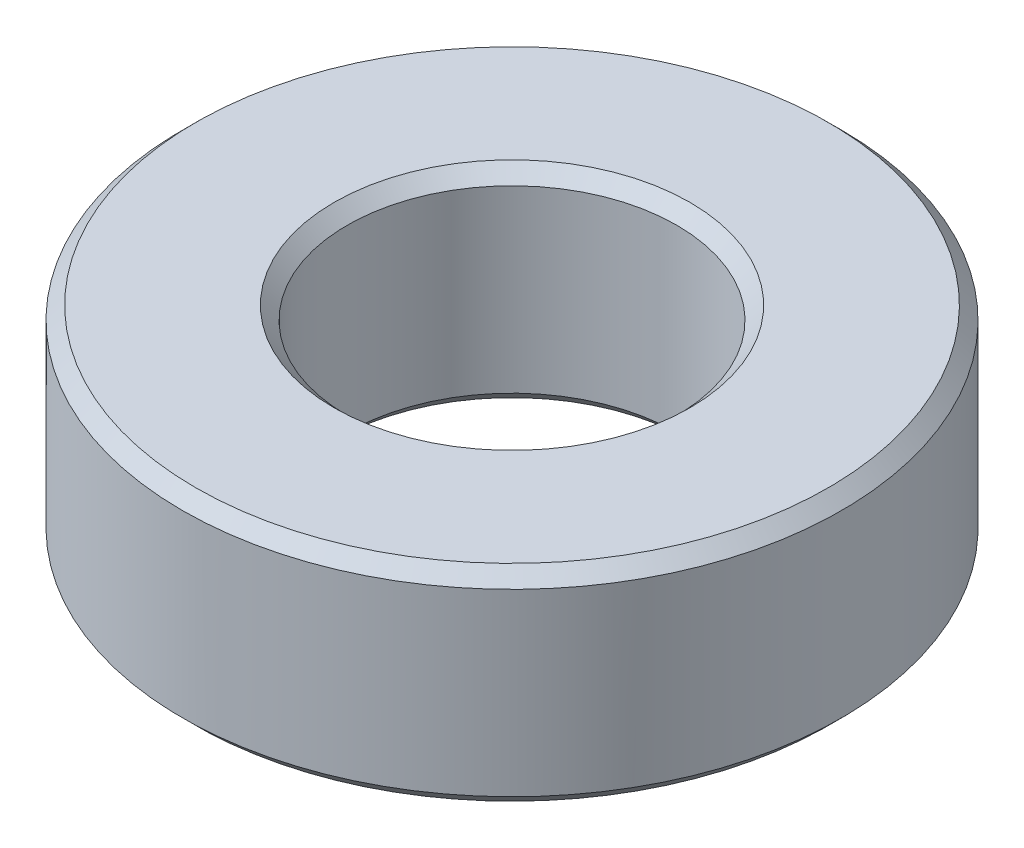
ISO-10303-21;
HEADER;
FILE_DESCRIPTION(('STEP AP214'),'2;1');
FILE_NAME('part.step','',(''),(''),'','','');
FILE_SCHEMA(('AUTOMOTIVE_DESIGN { 1 0 10303 214 1 1 1 1 }'));
ENDSEC;
DATA;
#1=APPLICATION_CONTEXT('core data for automotive mechanical design processes');
#2=APPLICATION_PROTOCOL_DEFINITION('international standard','automotive_design',2000,#1);
#3=PRODUCT_CONTEXT('',#1,'mechanical');
#4=PRODUCT('Part','Part','',(#3));
#5=PRODUCT_RELATED_PRODUCT_CATEGORY('part','',(#4));
#6=PRODUCT_DEFINITION_FORMATION('','',#4);
#7=PRODUCT_DEFINITION_CONTEXT('part definition',#1,'design');
#8=PRODUCT_DEFINITION('design','',#6,#7);
#9=PRODUCT_DEFINITION_SHAPE('','',#8);
#10=(LENGTH_UNIT() NAMED_UNIT(*) SI_UNIT(.MILLI.,.METRE.));
#11=(NAMED_UNIT(*) PLANE_ANGLE_UNIT() SI_UNIT($,.RADIAN.));
#12=(NAMED_UNIT(*) SI_UNIT($,.STERADIAN.) SOLID_ANGLE_UNIT());
#13=UNCERTAINTY_MEASURE_WITH_UNIT(LENGTH_MEASURE(1.E-05),#10,'distance_accuracy_value','');
#14=(GEOMETRIC_REPRESENTATION_CONTEXT(3) GLOBAL_UNCERTAINTY_ASSIGNED_CONTEXT((#13)) GLOBAL_UNIT_ASSIGNED_CONTEXT((#10,
#11,#12)) REPRESENTATION_CONTEXT('',''));
#15=CARTESIAN_POINT('',(0.,0.,0.));
#16=DIRECTION('',(0.,0.,1.));
#17=DIRECTION('',(1.,0.,0.));
#18=AXIS2_PLACEMENT_3D('',#15,#16,#17);
#19=CARTESIAN_POINT('',(6.35,1.984375,0.));
#20=DIRECTION('',(0.,1.,0.));
#21=DIRECTION('',(0.,0.,1.));
#22=AXIS2_PLACEMENT_3D('',#19,#20,#21);
#23=PLANE('',#22);
#24=CARTESIAN_POINT('',(0.,1.984375,0.));
#25=DIRECTION('',(0.,1.,0.));
#26=DIRECTION('',(0.,0.,1.));
#27=AXIS2_PLACEMENT_3D('',#24,#25,#26);
#28=CIRCLE('',#27,6.096);
#29=CARTESIAN_POINT('',(0.,1.984375,6.096));
#30=VERTEX_POINT('',#29);
#31=EDGE_CURVE('E41',#30,#30,#28,.T.);
#32=ORIENTED_EDGE('',*,*,#31,.T.);
#33=EDGE_LOOP('',(#32));
#34=FACE_BOUND('',#33,.T.);
#35=CARTESIAN_POINT('',(0.,1.984375,0.));
#36=DIRECTION('',(0.,1.,0.));
#37=DIRECTION('',(0.,0.,1.));
#38=AXIS2_PLACEMENT_3D('',#35,#36,#37);
#39=CIRCLE('',#38,3.429);
#40=CARTESIAN_POINT('',(0.,1.984375,3.429));
#41=VERTEX_POINT('',#40);
#42=EDGE_CURVE('E45',#41,#41,#39,.F.);
#43=ORIENTED_EDGE('',*,*,#42,.T.);
#44=EDGE_LOOP('',(#43));
#45=FACE_BOUND('',#44,.T.);
#46=ADVANCED_FACE('F30',(#34,#45),#23,.T.);
#47=CARTESIAN_POINT('',(0.,-0.652588939706115,0.));
#48=DIRECTION('',(0.,-1.,0.));
#49=DIRECTION('',(0.,0.,-1.));
#50=AXIS2_PLACEMENT_3D('',#47,#48,#49);
#51=CYLINDRICAL_SURFACE('',#50,3.175);
#52=CARTESIAN_POINT('',(0.,1.730375,0.));
#53=DIRECTION('',(0.,1.,0.));
#54=DIRECTION('',(0.,0.,1.));
#55=AXIS2_PLACEMENT_3D('',#52,#53,#54);
#56=CIRCLE('',#55,3.175);
#57=CARTESIAN_POINT('',(0.,1.730375,3.175));
#58=VERTEX_POINT('',#57);
#59=EDGE_CURVE('E10',#58,#58,#56,.T.);
#60=ORIENTED_EDGE('',*,*,#59,.T.);
#61=EDGE_LOOP('',(#60));
#62=FACE_BOUND('',#61,.T.);
#63=CARTESIAN_POINT('',(0.,-1.730375,0.));
#64=DIRECTION('',(0.,-1.,0.));
#65=DIRECTION('',(0.,0.,-1.));
#66=AXIS2_PLACEMENT_3D('',#63,#64,#65);
#67=CIRCLE('',#66,3.175);
#68=CARTESIAN_POINT('',(0.,-1.730375,-3.175));
#69=VERTEX_POINT('',#68);
#70=EDGE_CURVE('E37',#69,#69,#67,.T.);
#71=ORIENTED_EDGE('',*,*,#70,.T.);
#72=EDGE_LOOP('',(#71));
#73=FACE_BOUND('',#72,.T.);
#74=ADVANCED_FACE('F74',(#62,#73),#51,.F.);
#75=CARTESIAN_POINT('',(3.175,-1.984375,0.));
#76=DIRECTION('',(0.,-1.,0.));
#77=DIRECTION('',(0.,0.,-1.));
#78=AXIS2_PLACEMENT_3D('',#75,#76,#77);
#79=PLANE('',#78);
#80=CARTESIAN_POINT('',(0.,-1.984375,0.));
#81=DIRECTION('',(0.,-1.,0.));
#82=DIRECTION('',(0.,0.,-1.));
#83=AXIS2_PLACEMENT_3D('',#80,#81,#82);
#84=CIRCLE('',#83,6.096);
#85=CARTESIAN_POINT('',(0.,-1.984375,-6.096));
#86=VERTEX_POINT('',#85);
#87=EDGE_CURVE('E56',#86,#86,#84,.T.);
#88=ORIENTED_EDGE('',*,*,#87,.T.);
#89=EDGE_LOOP('',(#88));
#90=FACE_BOUND('',#89,.T.);
#91=CARTESIAN_POINT('',(0.,-1.984375,0.));
#92=DIRECTION('',(0.,-1.,0.));
#93=DIRECTION('',(0.,0.,-1.));
#94=AXIS2_PLACEMENT_3D('',#91,#92,#93);
#95=CIRCLE('',#94,3.429);
#96=CARTESIAN_POINT('',(0.,-1.984375,-3.429));
#97=VERTEX_POINT('',#96);
#98=EDGE_CURVE('E59',#97,#97,#95,.F.);
#99=ORIENTED_EDGE('',*,*,#98,.T.);
#100=EDGE_LOOP('',(#99));
#101=FACE_BOUND('',#100,.T.);
#102=ADVANCED_FACE('F63',(#90,#101),#79,.T.);
#103=CARTESIAN_POINT('',(0.,-0.652588939706115,0.));
#104=DIRECTION('',(0.,-1.,0.));
#105=DIRECTION('',(0.,0.,-1.));
#106=AXIS2_PLACEMENT_3D('',#103,#104,#105);
#107=CYLINDRICAL_SURFACE('',#106,6.35);
#108=CARTESIAN_POINT('',(0.,-1.73037499999999,0.));
#109=DIRECTION('',(0.,-1.,0.));
#110=DIRECTION('',(0.,0.,-1.));
#111=AXIS2_PLACEMENT_3D('',#108,#109,#110);
#112=CIRCLE('',#111,6.35);
#113=CARTESIAN_POINT('',(0.,-1.73037499999999,-6.35));
#114=VERTEX_POINT('',#113);
#115=EDGE_CURVE('E50',#114,#114,#112,.F.);
#116=ORIENTED_EDGE('',*,*,#115,.T.);
#117=EDGE_LOOP('',(#116));
#118=FACE_BOUND('',#117,.T.);
#119=CARTESIAN_POINT('',(0.,1.730375,0.));
#120=DIRECTION('',(0.,1.,0.));
#121=DIRECTION('',(0.,0.,1.));
#122=AXIS2_PLACEMENT_3D('',#119,#120,#121);
#123=CIRCLE('',#122,6.35);
#124=CARTESIAN_POINT('',(0.,1.730375,6.35));
#125=VERTEX_POINT('',#124);
#126=EDGE_CURVE('E53',#125,#125,#123,.F.);
#127=ORIENTED_EDGE('',*,*,#126,.T.);
#128=EDGE_LOOP('',(#127));
#129=FACE_BOUND('',#128,.T.);
#130=ADVANCED_FACE('F87',(#118,#129),#107,.T.);
#131=CARTESIAN_POINT('',(0.,-1.984375,0.));
#132=DIRECTION('',(0.,1.,0.));
#133=DIRECTION('',(0.,0.,1.));
#134=AXIS2_PLACEMENT_3D('',#131,#132,#133);
#135=CONICAL_SURFACE('',#134,6.096,0.785398163397443);
#136=ORIENTED_EDGE('',*,*,#115,.F.);
#137=EDGE_LOOP('',(#136));
#138=FACE_BOUND('',#137,.T.);
#139=ORIENTED_EDGE('',*,*,#87,.F.);
#140=EDGE_LOOP('',(#139));
#141=FACE_BOUND('',#140,.T.);
#142=ADVANCED_FACE('F84',(#138,#141),#135,.T.);
#143=CARTESIAN_POINT('',(0.,1.730375,0.));
#144=DIRECTION('',(0.,-1.,0.));
#145=DIRECTION('',(0.,0.,-1.));
#146=AXIS2_PLACEMENT_3D('',#143,#144,#145);
#147=CONICAL_SURFACE('',#146,6.35,0.78539816339745);
#148=ORIENTED_EDGE('',*,*,#31,.F.);
#149=EDGE_LOOP('',(#148));
#150=FACE_BOUND('',#149,.T.);
#151=ORIENTED_EDGE('',*,*,#126,.F.);
#152=EDGE_LOOP('',(#151));
#153=FACE_BOUND('',#152,.T.);
#154=ADVANCED_FACE('F71',(#150,#153),#147,.T.);
#155=CARTESIAN_POINT('',(0.,1.984375,0.));
#156=DIRECTION('',(0.,1.,0.));
#157=DIRECTION('',(0.,0.,1.));
#158=AXIS2_PLACEMENT_3D('',#155,#156,#157);
#159=CONICAL_SURFACE('',#158,3.429,0.785398163397444);
#160=ORIENTED_EDGE('',*,*,#59,.F.);
#161=EDGE_LOOP('',(#160));
#162=FACE_BOUND('',#161,.T.);
#163=ORIENTED_EDGE('',*,*,#42,.F.);
#164=EDGE_LOOP('',(#163));
#165=FACE_BOUND('',#164,.T.);
#166=ADVANCED_FACE('F67',(#162,#165),#159,.F.);
#167=CARTESIAN_POINT('',(0.,-1.730375,0.));
#168=DIRECTION('',(0.,-1.,0.));
#169=DIRECTION('',(0.,0.,-1.));
#170=AXIS2_PLACEMENT_3D('',#167,#168,#169);
#171=CONICAL_SURFACE('',#170,3.175,0.785398163397449);
#172=ORIENTED_EDGE('',*,*,#98,.F.);
#173=EDGE_LOOP('',(#172));
#174=FACE_BOUND('',#173,.T.);
#175=ORIENTED_EDGE('',*,*,#70,.F.);
#176=EDGE_LOOP('',(#175));
#177=FACE_BOUND('',#176,.T.);
#178=ADVANCED_FACE('F32',(#174,#177),#171,.F.);
#179=CLOSED_SHELL('',(#46,#74,#102,#130,#142,#154,#166,#178));
#180=MANIFOLD_SOLID_BREP('B2',#179);
#181=ADVANCED_BREP_SHAPE_REPRESENTATION('',(#18,#180),#14);
#182=SHAPE_DEFINITION_REPRESENTATION(#9,#181);
ENDSEC;
END-ISO-10303-21;
